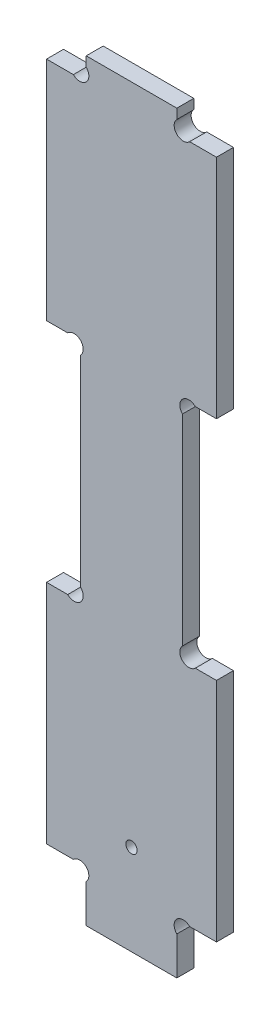
ISO-10303-21;
HEADER;
FILE_DESCRIPTION(('STEP AP214'),'2;1');
FILE_NAME('part.step','',(''),(''),'','','');
FILE_SCHEMA(('AUTOMOTIVE_DESIGN { 1 0 10303 214 1 1 1 1 }'));
ENDSEC;
DATA;
#1=APPLICATION_CONTEXT('core data for automotive mechanical design processes');
#2=APPLICATION_PROTOCOL_DEFINITION('international standard','automotive_design',2000,#1);
#3=PRODUCT_CONTEXT('',#1,'mechanical');
#4=PRODUCT('Part','Part','',(#3));
#5=PRODUCT_RELATED_PRODUCT_CATEGORY('part','',(#4));
#6=PRODUCT_DEFINITION_FORMATION('','',#4);
#7=PRODUCT_DEFINITION_CONTEXT('part definition',#1,'design');
#8=PRODUCT_DEFINITION('design','',#6,#7);
#9=PRODUCT_DEFINITION_SHAPE('','',#8);
#10=(LENGTH_UNIT() NAMED_UNIT(*) SI_UNIT(.MILLI.,.METRE.));
#11=(NAMED_UNIT(*) PLANE_ANGLE_UNIT() SI_UNIT($,.RADIAN.));
#12=(NAMED_UNIT(*) SI_UNIT($,.STERADIAN.) SOLID_ANGLE_UNIT());
#13=UNCERTAINTY_MEASURE_WITH_UNIT(LENGTH_MEASURE(1.E-05),#10,'distance_accuracy_value','');
#14=(GEOMETRIC_REPRESENTATION_CONTEXT(3) GLOBAL_UNCERTAINTY_ASSIGNED_CONTEXT((#13)) GLOBAL_UNIT_ASSIGNED_CONTEXT((#10,
#11,#12)) REPRESENTATION_CONTEXT('',''));
#15=CARTESIAN_POINT('',(0.,0.,0.));
#16=DIRECTION('',(0.,0.,1.));
#17=DIRECTION('',(1.,0.,0.));
#18=AXIS2_PLACEMENT_3D('',#15,#16,#17);
#19=CARTESIAN_POINT('',(30.,49.,3.));
#20=DIRECTION('',(-1.,0.,0.));
#21=DIRECTION('',(0.,-1.,0.));
#22=AXIS2_PLACEMENT_3D('',#19,#20,#21);
#23=PLANE('',#22);
#24=DIRECTION('',(0.,1.,0.));
#25=VECTOR('',#24,1.);
#26=CARTESIAN_POINT('',(30.,49.,0.));
#27=LINE('',#26,#25);
#28=CARTESIAN_POINT('',(30.,9.,0.));
#29=VERTEX_POINT('',#28);
#30=CARTESIAN_POINT('',(30.,49.,0.));
#31=VERTEX_POINT('',#30);
#32=EDGE_CURVE('E249',#29,#31,#27,.T.);
#33=ORIENTED_EDGE('',*,*,#32,.T.);
#34=DIRECTION('',(0.,0.,-1.));
#35=VECTOR('',#34,1.);
#36=CARTESIAN_POINT('',(30.,49.,3.));
#37=LINE('',#36,#35);
#38=CARTESIAN_POINT('',(30.,49.,3.));
#39=VERTEX_POINT('',#38);
#40=EDGE_CURVE('E11',#39,#31,#37,.T.);
#41=ORIENTED_EDGE('',*,*,#40,.F.);
#42=DIRECTION('',(0.,1.,0.));
#43=VECTOR('',#42,1.);
#44=CARTESIAN_POINT('',(30.,49.,3.));
#45=LINE('',#44,#43);
#46=CARTESIAN_POINT('',(30.,9.,3.));
#47=VERTEX_POINT('',#46);
#48=EDGE_CURVE('E304',#47,#39,#45,.T.);
#49=ORIENTED_EDGE('',*,*,#48,.F.);
#50=DIRECTION('',(0.,0.,-1.));
#51=VECTOR('',#50,1.);
#52=CARTESIAN_POINT('',(30.,9.,3.));
#53=LINE('',#52,#51);
#54=EDGE_CURVE('E245',#47,#29,#53,.T.);
#55=ORIENTED_EDGE('',*,*,#54,.T.);
#56=EDGE_LOOP('',(#33,#41,#49,#55));
#57=FACE_BOUND('',#56,.T.);
#58=ADVANCED_FACE('F33',(#57),#23,.F.);
#59=CARTESIAN_POINT('',(26.262741699797,49.,3.));
#60=DIRECTION('',(0.,-1.,0.));
#61=DIRECTION('',(0.,0.,-1.));
#62=AXIS2_PLACEMENT_3D('',#59,#60,#61);
#63=PLANE('',#62);
#64=DIRECTION('',(-1.,0.,0.));
#65=VECTOR('',#64,1.);
#66=CARTESIAN_POINT('',(26.262741699797,49.,0.));
#67=LINE('',#66,#65);
#68=CARTESIAN_POINT('',(26.262741699797,49.,0.));
#69=VERTEX_POINT('',#68);
#70=EDGE_CURVE('E252',#31,#69,#67,.T.);
#71=ORIENTED_EDGE('',*,*,#70,.T.);
#72=DIRECTION('',(0.,0.,-1.));
#73=VECTOR('',#72,1.);
#74=CARTESIAN_POINT('',(26.262741699797,49.,3.));
#75=LINE('',#74,#73);
#76=CARTESIAN_POINT('',(26.262741699797,49.,3.));
#77=VERTEX_POINT('',#76);
#78=EDGE_CURVE('E41',#77,#69,#75,.T.);
#79=ORIENTED_EDGE('',*,*,#78,.F.);
#80=DIRECTION('',(-1.,0.,0.));
#81=VECTOR('',#80,1.);
#82=CARTESIAN_POINT('',(26.262741699797,49.,3.));
#83=LINE('',#82,#81);
#84=EDGE_CURVE('E152',#39,#77,#83,.T.);
#85=ORIENTED_EDGE('',*,*,#84,.F.);
#86=ORIENTED_EDGE('',*,*,#40,.T.);
#87=EDGE_LOOP('',(#71,#79,#85,#86));
#88=FACE_BOUND('',#87,.T.);
#89=ADVANCED_FACE('F464',(#88),#63,.F.);
#90=CARTESIAN_POINT('',(25.1313708498985,50.1313708498985,3.));
#91=DIRECTION('',(0.,0.,-1.));
#92=DIRECTION('',(-1.,0.,0.));
#93=AXIS2_PLACEMENT_3D('',#90,#91,#92);
#94=CYLINDRICAL_SURFACE('',#93,1.60000000000001);
#95=CARTESIAN_POINT('',(25.1313708498985,50.1313708498985,0.));
#96=DIRECTION('',(0.,0.,-1.));
#97=DIRECTION('',(1.,0.,0.));
#98=AXIS2_PLACEMENT_3D('',#95,#96,#97);
#99=CIRCLE('',#98,1.60000000000001);
#100=CARTESIAN_POINT('',(24.,51.262741699797,0.));
#101=VERTEX_POINT('',#100);
#102=EDGE_CURVE('E255',#69,#101,#99,.T.);
#103=ORIENTED_EDGE('',*,*,#102,.T.);
#104=DIRECTION('',(0.,0.,-1.));
#105=VECTOR('',#104,1.);
#106=CARTESIAN_POINT('',(24.,51.262741699797,3.));
#107=LINE('',#106,#105);
#108=CARTESIAN_POINT('',(24.,51.262741699797,3.));
#109=VERTEX_POINT('',#108);
#110=EDGE_CURVE('E371',#109,#101,#107,.T.);
#111=ORIENTED_EDGE('',*,*,#110,.F.);
#112=CARTESIAN_POINT('',(25.1313708498985,50.1313708498985,3.));
#113=DIRECTION('',(0.,0.,-1.));
#114=DIRECTION('',(1.,0.,0.));
#115=AXIS2_PLACEMENT_3D('',#112,#113,#114);
#116=CIRCLE('',#115,1.60000000000001);
#117=EDGE_CURVE('E379',#77,#109,#116,.T.);
#118=ORIENTED_EDGE('',*,*,#117,.F.);
#119=ORIENTED_EDGE('',*,*,#78,.T.);
#120=EDGE_LOOP('',(#103,#111,#118,#119));
#121=FACE_BOUND('',#120,.T.);
#122=ADVANCED_FACE('F377',(#121),#94,.F.);
#123=CARTESIAN_POINT('',(24.,86.737258300203,3.));
#124=DIRECTION('',(-1.,0.,0.));
#125=DIRECTION('',(0.,-1.,0.));
#126=AXIS2_PLACEMENT_3D('',#123,#124,#125);
#127=PLANE('',#126);
#128=DIRECTION('',(0.,1.,0.));
#129=VECTOR('',#128,1.);
#130=CARTESIAN_POINT('',(24.,86.737258300203,0.));
#131=LINE('',#130,#129);
#132=CARTESIAN_POINT('',(24.,86.737258300203,0.));
#133=VERTEX_POINT('',#132);
#134=EDGE_CURVE('E257',#101,#133,#131,.T.);
#135=ORIENTED_EDGE('',*,*,#134,.T.);
#136=DIRECTION('',(0.,0.,-1.));
#137=VECTOR('',#136,1.);
#138=CARTESIAN_POINT('',(24.,86.737258300203,3.));
#139=LINE('',#138,#137);
#140=CARTESIAN_POINT('',(24.,86.737258300203,3.));
#141=VERTEX_POINT('',#140);
#142=EDGE_CURVE('E368',#141,#133,#139,.T.);
#143=ORIENTED_EDGE('',*,*,#142,.F.);
#144=DIRECTION('',(0.,1.,0.));
#145=VECTOR('',#144,1.);
#146=CARTESIAN_POINT('',(24.,86.737258300203,3.));
#147=LINE('',#146,#145);
#148=EDGE_CURVE('E397',#109,#141,#147,.T.);
#149=ORIENTED_EDGE('',*,*,#148,.F.);
#150=ORIENTED_EDGE('',*,*,#110,.T.);
#151=EDGE_LOOP('',(#135,#143,#149,#150));
#152=FACE_BOUND('',#151,.T.);
#153=ADVANCED_FACE('F388',(#152),#127,.F.);
#154=CARTESIAN_POINT('',(25.1313708498985,87.8686291501015,3.));
#155=DIRECTION('',(0.,0.,-1.));
#156=DIRECTION('',(-1.,0.,0.));
#157=AXIS2_PLACEMENT_3D('',#154,#155,#156);
#158=CYLINDRICAL_SURFACE('',#157,1.6);
#159=CARTESIAN_POINT('',(25.1313708498985,87.8686291501015,0.));
#160=DIRECTION('',(0.,0.,-1.));
#161=DIRECTION('',(-1.,0.,0.));
#162=AXIS2_PLACEMENT_3D('',#159,#160,#161);
#163=CIRCLE('',#162,1.6);
#164=CARTESIAN_POINT('',(26.2627416997969,89.,0.));
#165=VERTEX_POINT('',#164);
#166=EDGE_CURVE('E259',#133,#165,#163,.T.);
#167=ORIENTED_EDGE('',*,*,#166,.T.);
#168=DIRECTION('',(0.,0.,-1.));
#169=VECTOR('',#168,1.);
#170=CARTESIAN_POINT('',(26.2627416997969,89.,3.));
#171=LINE('',#170,#169);
#172=CARTESIAN_POINT('',(26.2627416997969,89.,3.));
#173=VERTEX_POINT('',#172);
#174=EDGE_CURVE('E365',#173,#165,#171,.T.);
#175=ORIENTED_EDGE('',*,*,#174,.F.);
#176=CARTESIAN_POINT('',(25.1313708498985,87.8686291501015,3.));
#177=DIRECTION('',(0.,0.,-1.));
#178=DIRECTION('',(-1.,0.,0.));
#179=AXIS2_PLACEMENT_3D('',#176,#177,#178);
#180=CIRCLE('',#179,1.6);
#181=EDGE_CURVE('E394',#141,#173,#180,.T.);
#182=ORIENTED_EDGE('',*,*,#181,.F.);
#183=ORIENTED_EDGE('',*,*,#142,.T.);
#184=EDGE_LOOP('',(#167,#175,#182,#183));
#185=FACE_BOUND('',#184,.T.);
#186=ADVANCED_FACE('F392',(#185),#158,.F.);
#187=CARTESIAN_POINT('',(26.2627416997969,89.,3.));
#188=DIRECTION('',(0.,1.,0.));
#189=DIRECTION('',(0.,0.,1.));
#190=AXIS2_PLACEMENT_3D('',#187,#188,#189);
#191=PLANE('',#190);
#192=DIRECTION('',(1.,0.,0.));
#193=VECTOR('',#192,1.);
#194=CARTESIAN_POINT('',(26.2627416997969,89.,0.));
#195=LINE('',#194,#193);
#196=CARTESIAN_POINT('',(30.,89.,0.));
#197=VERTEX_POINT('',#196);
#198=EDGE_CURVE('E261',#165,#197,#195,.T.);
#199=ORIENTED_EDGE('',*,*,#198,.T.);
#200=DIRECTION('',(0.,0.,-1.));
#201=VECTOR('',#200,1.);
#202=CARTESIAN_POINT('',(30.,89.,3.));
#203=LINE('',#202,#201);
#204=CARTESIAN_POINT('',(30.,89.,3.));
#205=VERTEX_POINT('',#204);
#206=EDGE_CURVE('E362',#205,#197,#203,.T.);
#207=ORIENTED_EDGE('',*,*,#206,.F.);
#208=DIRECTION('',(1.,0.,0.));
#209=VECTOR('',#208,1.);
#210=CARTESIAN_POINT('',(26.2627416997969,89.,3.));
#211=LINE('',#210,#209);
#212=EDGE_CURVE('E396',#173,#205,#211,.T.);
#213=ORIENTED_EDGE('',*,*,#212,.F.);
#214=ORIENTED_EDGE('',*,*,#174,.T.);
#215=EDGE_LOOP('',(#199,#207,#213,#214));
#216=FACE_BOUND('',#215,.T.);
#217=ADVANCED_FACE('F477',(#216),#191,.F.);
#218=CARTESIAN_POINT('',(30.,89.,3.));
#219=DIRECTION('',(-1.,0.,0.));
#220=DIRECTION('',(0.,0.,1.));
#221=AXIS2_PLACEMENT_3D('',#218,#219,#220);
#222=PLANE('',#221);
#223=DIRECTION('',(0.,1.,0.));
#224=VECTOR('',#223,1.);
#225=CARTESIAN_POINT('',(30.,89.,0.));
#226=LINE('',#225,#224);
#227=CARTESIAN_POINT('',(30.,129.,0.));
#228=VERTEX_POINT('',#227);
#229=EDGE_CURVE('E263',#197,#228,#226,.T.);
#230=ORIENTED_EDGE('',*,*,#229,.T.);
#231=DIRECTION('',(0.,0.,-1.));
#232=VECTOR('',#231,1.);
#233=CARTESIAN_POINT('',(30.,129.,3.));
#234=LINE('',#233,#232);
#235=CARTESIAN_POINT('',(30.,129.,3.));
#236=VERTEX_POINT('',#235);
#237=EDGE_CURVE('E359',#236,#228,#234,.T.);
#238=ORIENTED_EDGE('',*,*,#237,.F.);
#239=DIRECTION('',(0.,1.,0.));
#240=VECTOR('',#239,1.);
#241=CARTESIAN_POINT('',(30.,89.,3.));
#242=LINE('',#241,#240);
#243=EDGE_CURVE('E399',#205,#236,#242,.T.);
#244=ORIENTED_EDGE('',*,*,#243,.F.);
#245=ORIENTED_EDGE('',*,*,#206,.T.);
#246=EDGE_LOOP('',(#230,#238,#244,#245));
#247=FACE_BOUND('',#246,.T.);
#248=ADVANCED_FACE('F480',(#247),#222,.F.);
#249=CARTESIAN_POINT('',(25.262741699797,129.,3.));
#250=DIRECTION('',(0.,-1.,0.));
#251=DIRECTION('',(0.,0.,-1.));
#252=AXIS2_PLACEMENT_3D('',#249,#250,#251);
#253=PLANE('',#252);
#254=DIRECTION('',(-1.,0.,0.));
#255=VECTOR('',#254,1.);
#256=CARTESIAN_POINT('',(25.262741699797,129.,0.));
#257=LINE('',#256,#255);
#258=CARTESIAN_POINT('',(25.262741699797,129.,0.));
#259=VERTEX_POINT('',#258);
#260=EDGE_CURVE('E265',#228,#259,#257,.T.);
#261=ORIENTED_EDGE('',*,*,#260,.T.);
#262=DIRECTION('',(0.,0.,-1.));
#263=VECTOR('',#262,1.);
#264=CARTESIAN_POINT('',(25.262741699797,129.,3.));
#265=LINE('',#264,#263);
#266=CARTESIAN_POINT('',(25.262741699797,129.,3.));
#267=VERTEX_POINT('',#266);
#268=EDGE_CURVE('E356',#267,#259,#265,.T.);
#269=ORIENTED_EDGE('',*,*,#268,.F.);
#270=DIRECTION('',(-1.,0.,0.));
#271=VECTOR('',#270,1.);
#272=CARTESIAN_POINT('',(25.262741699797,129.,3.));
#273=LINE('',#272,#271);
#274=EDGE_CURVE('E405',#236,#267,#273,.T.);
#275=ORIENTED_EDGE('',*,*,#274,.F.);
#276=ORIENTED_EDGE('',*,*,#237,.T.);
#277=EDGE_LOOP('',(#261,#269,#275,#276));
#278=FACE_BOUND('',#277,.T.);
#279=ADVANCED_FACE('F484',(#278),#253,.F.);
#280=CARTESIAN_POINT('',(24.1313708498985,130.131370849898,3.));
#281=DIRECTION('',(0.,0.,-1.));
#282=DIRECTION('',(-1.,0.,0.));
#283=AXIS2_PLACEMENT_3D('',#280,#281,#282);
#284=CYLINDRICAL_SURFACE('',#283,1.60000000000001);
#285=CARTESIAN_POINT('',(24.1313708498985,130.131370849898,0.));
#286=DIRECTION('',(0.,0.,-1.));
#287=DIRECTION('',(-1.,0.,0.));
#288=AXIS2_PLACEMENT_3D('',#285,#286,#287);
#289=CIRCLE('',#288,1.60000000000001);
#290=CARTESIAN_POINT('',(23.,131.262741699797,0.));
#291=VERTEX_POINT('',#290);
#292=EDGE_CURVE('E267',#259,#291,#289,.T.);
#293=ORIENTED_EDGE('',*,*,#292,.T.);
#294=DIRECTION('',(0.,0.,-1.));
#295=VECTOR('',#294,1.);
#296=CARTESIAN_POINT('',(23.,131.262741699797,3.));
#297=LINE('',#296,#295);
#298=CARTESIAN_POINT('',(23.,131.262741699797,3.));
#299=VERTEX_POINT('',#298);
#300=EDGE_CURVE('E353',#299,#291,#297,.T.);
#301=ORIENTED_EDGE('',*,*,#300,.F.);
#302=CARTESIAN_POINT('',(24.1313708498985,130.131370849898,3.));
#303=DIRECTION('',(0.,0.,-1.));
#304=DIRECTION('',(-1.,0.,0.));
#305=AXIS2_PLACEMENT_3D('',#302,#303,#304);
#306=CIRCLE('',#305,1.60000000000001);
#307=EDGE_CURVE('E407',#267,#299,#306,.T.);
#308=ORIENTED_EDGE('',*,*,#307,.F.);
#309=ORIENTED_EDGE('',*,*,#268,.T.);
#310=EDGE_LOOP('',(#293,#301,#308,#309));
#311=FACE_BOUND('',#310,.T.);
#312=ADVANCED_FACE('F488',(#311),#284,.F.);
#313=CARTESIAN_POINT('',(23.,131.262741699797,3.));
#314=DIRECTION('',(-1.,0.,0.));
#315=DIRECTION('',(0.,0.,1.));
#316=AXIS2_PLACEMENT_3D('',#313,#314,#315);
#317=PLANE('',#316);
#318=DIRECTION('',(0.,1.,0.));
#319=VECTOR('',#318,1.);
#320=CARTESIAN_POINT('',(23.,131.262741699797,0.));
#321=LINE('',#320,#319);
#322=CARTESIAN_POINT('',(23.,133.,0.));
#323=VERTEX_POINT('',#322);
#324=EDGE_CURVE('E269',#291,#323,#321,.T.);
#325=ORIENTED_EDGE('',*,*,#324,.T.);
#326=DIRECTION('',(0.,0.,-1.));
#327=VECTOR('',#326,1.);
#328=CARTESIAN_POINT('',(23.,133.,3.));
#329=LINE('',#328,#327);
#330=CARTESIAN_POINT('',(23.,133.,3.));
#331=VERTEX_POINT('',#330);
#332=EDGE_CURVE('E350',#331,#323,#329,.T.);
#333=ORIENTED_EDGE('',*,*,#332,.F.);
#334=DIRECTION('',(0.,1.,0.));
#335=VECTOR('',#334,1.);
#336=CARTESIAN_POINT('',(23.,131.262741699797,3.));
#337=LINE('',#336,#335);
#338=EDGE_CURVE('E409',#299,#331,#337,.T.);
#339=ORIENTED_EDGE('',*,*,#338,.F.);
#340=ORIENTED_EDGE('',*,*,#300,.T.);
#341=EDGE_LOOP('',(#325,#333,#339,#340));
#342=FACE_BOUND('',#341,.T.);
#343=ADVANCED_FACE('F492',(#342),#317,.F.);
#344=CARTESIAN_POINT('',(6.99999999999998,133.,3.));
#345=DIRECTION('',(0.,-1.,0.));
#346=DIRECTION('',(0.,0.,-1.));
#347=AXIS2_PLACEMENT_3D('',#344,#345,#346);
#348=PLANE('',#347);
#349=DIRECTION('',(-1.,0.,0.));
#350=VECTOR('',#349,1.);
#351=CARTESIAN_POINT('',(6.99999999999998,133.,0.));
#352=LINE('',#351,#350);
#353=CARTESIAN_POINT('',(6.99999999999998,133.,0.));
#354=VERTEX_POINT('',#353);
#355=EDGE_CURVE('E271',#323,#354,#352,.T.);
#356=ORIENTED_EDGE('',*,*,#355,.T.);
#357=DIRECTION('',(0.,0.,-1.));
#358=VECTOR('',#357,1.);
#359=CARTESIAN_POINT('',(6.99999999999998,133.,3.));
#360=LINE('',#359,#358);
#361=CARTESIAN_POINT('',(6.99999999999998,133.,3.));
#362=VERTEX_POINT('',#361);
#363=EDGE_CURVE('E347',#362,#354,#360,.T.);
#364=ORIENTED_EDGE('',*,*,#363,.F.);
#365=DIRECTION('',(-1.,0.,0.));
#366=VECTOR('',#365,1.);
#367=CARTESIAN_POINT('',(6.99999999999998,133.,3.));
#368=LINE('',#367,#366);
#369=EDGE_CURVE('E411',#331,#362,#368,.T.);
#370=ORIENTED_EDGE('',*,*,#369,.F.);
#371=ORIENTED_EDGE('',*,*,#332,.T.);
#372=EDGE_LOOP('',(#356,#364,#370,#371));
#373=FACE_BOUND('',#372,.T.);
#374=ADVANCED_FACE('F496',(#373),#348,.F.);
#375=CARTESIAN_POINT('',(6.99999999999998,131.262741699797,3.));
#376=DIRECTION('',(1.,0.,0.));
#377=DIRECTION('',(0.,0.,-1.));
#378=AXIS2_PLACEMENT_3D('',#375,#376,#377);
#379=PLANE('',#378);
#380=DIRECTION('',(0.,-1.,0.));
#381=VECTOR('',#380,1.);
#382=CARTESIAN_POINT('',(6.99999999999998,131.262741699797,0.));
#383=LINE('',#382,#381);
#384=CARTESIAN_POINT('',(6.99999999999998,131.262741699797,0.));
#385=VERTEX_POINT('',#384);
#386=EDGE_CURVE('E273',#354,#385,#383,.T.);
#387=ORIENTED_EDGE('',*,*,#386,.T.);
#388=DIRECTION('',(0.,0.,-1.));
#389=VECTOR('',#388,1.);
#390=CARTESIAN_POINT('',(6.99999999999998,131.262741699797,3.));
#391=LINE('',#390,#389);
#392=CARTESIAN_POINT('',(6.99999999999998,131.262741699797,3.));
#393=VERTEX_POINT('',#392);
#394=EDGE_CURVE('E344',#393,#385,#391,.T.);
#395=ORIENTED_EDGE('',*,*,#394,.F.);
#396=DIRECTION('',(0.,-1.,0.));
#397=VECTOR('',#396,1.);
#398=CARTESIAN_POINT('',(6.99999999999998,131.262741699797,3.));
#399=LINE('',#398,#397);
#400=EDGE_CURVE('E413',#362,#393,#399,.T.);
#401=ORIENTED_EDGE('',*,*,#400,.F.);
#402=ORIENTED_EDGE('',*,*,#363,.T.);
#403=EDGE_LOOP('',(#387,#395,#401,#402));
#404=FACE_BOUND('',#403,.T.);
#405=ADVANCED_FACE('F500',(#404),#379,.F.);
#406=CARTESIAN_POINT('',(5.8686291501015,130.131370849898,3.));
#407=DIRECTION('',(0.,0.,-1.));
#408=DIRECTION('',(-1.,0.,0.));
#409=AXIS2_PLACEMENT_3D('',#406,#407,#408);
#410=CYLINDRICAL_SURFACE('',#409,1.6);
#411=CARTESIAN_POINT('',(5.8686291501015,130.131370849898,0.));
#412=DIRECTION('',(0.,0.,-1.));
#413=DIRECTION('',(1.,0.,0.));
#414=AXIS2_PLACEMENT_3D('',#411,#412,#413);
#415=CIRCLE('',#414,1.6);
#416=CARTESIAN_POINT('',(4.73725830020302,129.,0.));
#417=VERTEX_POINT('',#416);
#418=EDGE_CURVE('E275',#385,#417,#415,.T.);
#419=ORIENTED_EDGE('',*,*,#418,.T.);
#420=DIRECTION('',(0.,0.,-1.));
#421=VECTOR('',#420,1.);
#422=CARTESIAN_POINT('',(4.73725830020302,129.,3.));
#423=LINE('',#422,#421);
#424=CARTESIAN_POINT('',(4.73725830020302,129.,3.));
#425=VERTEX_POINT('',#424);
#426=EDGE_CURVE('E341',#425,#417,#423,.T.);
#427=ORIENTED_EDGE('',*,*,#426,.F.);
#428=CARTESIAN_POINT('',(5.8686291501015,130.131370849898,3.));
#429=DIRECTION('',(0.,0.,-1.));
#430=DIRECTION('',(1.,0.,0.));
#431=AXIS2_PLACEMENT_3D('',#428,#429,#430);
#432=CIRCLE('',#431,1.6);
#433=EDGE_CURVE('E415',#393,#425,#432,.T.);
#434=ORIENTED_EDGE('',*,*,#433,.F.);
#435=ORIENTED_EDGE('',*,*,#394,.T.);
#436=EDGE_LOOP('',(#419,#427,#434,#435));
#437=FACE_BOUND('',#436,.T.);
#438=ADVANCED_FACE('F504',(#437),#410,.F.);
#439=CARTESIAN_POINT('',(4.73725830020302,129.,3.));
#440=DIRECTION('',(0.,-1.,0.));
#441=DIRECTION('',(0.,0.,-1.));
#442=AXIS2_PLACEMENT_3D('',#439,#440,#441);
#443=PLANE('',#442);
#444=DIRECTION('',(-1.,0.,0.));
#445=VECTOR('',#444,1.);
#446=CARTESIAN_POINT('',(4.73725830020302,129.,0.));
#447=LINE('',#446,#445);
#448=CARTESIAN_POINT('',(0.,129.,0.));
#449=VERTEX_POINT('',#448);
#450=EDGE_CURVE('E277',#417,#449,#447,.T.);
#451=ORIENTED_EDGE('',*,*,#450,.T.);
#452=DIRECTION('',(0.,0.,-1.));
#453=VECTOR('',#452,1.);
#454=CARTESIAN_POINT('',(0.,129.,3.));
#455=LINE('',#454,#453);
#456=CARTESIAN_POINT('',(0.,129.,3.));
#457=VERTEX_POINT('',#456);
#458=EDGE_CURVE('E338',#457,#449,#455,.T.);
#459=ORIENTED_EDGE('',*,*,#458,.F.);
#460=DIRECTION('',(-1.,0.,0.));
#461=VECTOR('',#460,1.);
#462=CARTESIAN_POINT('',(4.73725830020302,129.,3.));
#463=LINE('',#462,#461);
#464=EDGE_CURVE('E417',#425,#457,#463,.T.);
#465=ORIENTED_EDGE('',*,*,#464,.F.);
#466=ORIENTED_EDGE('',*,*,#426,.T.);
#467=EDGE_LOOP('',(#451,#459,#465,#466));
#468=FACE_BOUND('',#467,.T.);
#469=ADVANCED_FACE('F508',(#468),#443,.F.);
#470=CARTESIAN_POINT('',(0.,89.,3.));
#471=DIRECTION('',(1.,0.,0.));
#472=DIRECTION('',(0.,1.,0.));
#473=AXIS2_PLACEMENT_3D('',#470,#471,#472);
#474=PLANE('',#473);
#475=DIRECTION('',(0.,-1.,0.));
#476=VECTOR('',#475,1.);
#477=CARTESIAN_POINT('',(0.,89.,0.));
#478=LINE('',#477,#476);
#479=CARTESIAN_POINT('',(0.,89.,0.));
#480=VERTEX_POINT('',#479);
#481=EDGE_CURVE('E279',#449,#480,#478,.T.);
#482=ORIENTED_EDGE('',*,*,#481,.T.);
#483=DIRECTION('',(0.,0.,-1.));
#484=VECTOR('',#483,1.);
#485=CARTESIAN_POINT('',(0.,89.,3.));
#486=LINE('',#485,#484);
#487=CARTESIAN_POINT('',(0.,89.,3.));
#488=VERTEX_POINT('',#487);
#489=EDGE_CURVE('E335',#488,#480,#486,.T.);
#490=ORIENTED_EDGE('',*,*,#489,.F.);
#491=DIRECTION('',(0.,-1.,0.));
#492=VECTOR('',#491,1.);
#493=CARTESIAN_POINT('',(0.,89.,3.));
#494=LINE('',#493,#492);
#495=EDGE_CURVE('E419',#457,#488,#494,.T.);
#496=ORIENTED_EDGE('',*,*,#495,.F.);
#497=ORIENTED_EDGE('',*,*,#458,.T.);
#498=EDGE_LOOP('',(#482,#490,#496,#497));
#499=FACE_BOUND('',#498,.T.);
#500=ADVANCED_FACE('F512',(#499),#474,.F.);
#501=CARTESIAN_POINT('',(3.73725830020304,89.,3.));
#502=DIRECTION('',(0.,1.,0.));
#503=DIRECTION('',(0.,0.,1.));
#504=AXIS2_PLACEMENT_3D('',#501,#502,#503);
#505=PLANE('',#504);
#506=DIRECTION('',(1.,0.,0.));
#507=VECTOR('',#506,1.);
#508=CARTESIAN_POINT('',(3.73725830020304,89.,0.));
#509=LINE('',#508,#507);
#510=CARTESIAN_POINT('',(3.73725830020304,89.,0.));
#511=VERTEX_POINT('',#510);
#512=EDGE_CURVE('E281',#480,#511,#509,.T.);
#513=ORIENTED_EDGE('',*,*,#512,.T.);
#514=DIRECTION('',(0.,0.,-1.));
#515=VECTOR('',#514,1.);
#516=CARTESIAN_POINT('',(3.73725830020304,89.,3.));
#517=LINE('',#516,#515);
#518=CARTESIAN_POINT('',(3.73725830020304,89.,3.));
#519=VERTEX_POINT('',#518);
#520=EDGE_CURVE('E332',#519,#511,#517,.T.);
#521=ORIENTED_EDGE('',*,*,#520,.F.);
#522=DIRECTION('',(1.,0.,0.));
#523=VECTOR('',#522,1.);
#524=CARTESIAN_POINT('',(3.73725830020304,89.,3.));
#525=LINE('',#524,#523);
#526=EDGE_CURVE('E421',#488,#519,#525,.T.);
#527=ORIENTED_EDGE('',*,*,#526,.F.);
#528=ORIENTED_EDGE('',*,*,#489,.T.);
#529=EDGE_LOOP('',(#513,#521,#527,#528));
#530=FACE_BOUND('',#529,.T.);
#531=ADVANCED_FACE('F516',(#530),#505,.F.);
#532=CARTESIAN_POINT('',(4.86862915010152,87.8686291501015,3.));
#533=DIRECTION('',(0.,0.,-1.));
#534=DIRECTION('',(-1.,0.,0.));
#535=AXIS2_PLACEMENT_3D('',#532,#533,#534);
#536=CYLINDRICAL_SURFACE('',#535,1.6);
#537=CARTESIAN_POINT('',(4.86862915010152,87.8686291501015,0.));
#538=DIRECTION('',(0.,0.,-1.));
#539=DIRECTION('',(1.,0.,0.));
#540=AXIS2_PLACEMENT_3D('',#537,#538,#539);
#541=CIRCLE('',#540,1.6);
#542=CARTESIAN_POINT('',(5.99999999999999,86.737258300203,0.));
#543=VERTEX_POINT('',#542);
#544=EDGE_CURVE('E283',#511,#543,#541,.T.);
#545=ORIENTED_EDGE('',*,*,#544,.T.);
#546=DIRECTION('',(0.,0.,-1.));
#547=VECTOR('',#546,1.);
#548=CARTESIAN_POINT('',(5.99999999999999,86.737258300203,3.));
#549=LINE('',#548,#547);
#550=CARTESIAN_POINT('',(5.99999999999999,86.737258300203,3.));
#551=VERTEX_POINT('',#550);
#552=EDGE_CURVE('E329',#551,#543,#549,.T.);
#553=ORIENTED_EDGE('',*,*,#552,.F.);
#554=CARTESIAN_POINT('',(4.86862915010152,87.8686291501015,3.));
#555=DIRECTION('',(0.,0.,-1.));
#556=DIRECTION('',(1.,0.,0.));
#557=AXIS2_PLACEMENT_3D('',#554,#555,#556);
#558=CIRCLE('',#557,1.6);
#559=EDGE_CURVE('E423',#519,#551,#558,.T.);
#560=ORIENTED_EDGE('',*,*,#559,.F.);
#561=ORIENTED_EDGE('',*,*,#520,.T.);
#562=EDGE_LOOP('',(#545,#553,#560,#561));
#563=FACE_BOUND('',#562,.T.);
#564=ADVANCED_FACE('F520',(#563),#536,.F.);
#565=CARTESIAN_POINT('',(5.99999999999999,86.737258300203,3.));
#566=DIRECTION('',(1.,0.,0.));
#567=DIRECTION('',(0.,1.,0.));
#568=AXIS2_PLACEMENT_3D('',#565,#566,#567);
#569=PLANE('',#568);
#570=DIRECTION('',(0.,-1.,0.));
#571=VECTOR('',#570,1.);
#572=CARTESIAN_POINT('',(5.99999999999999,86.737258300203,0.));
#573=LINE('',#572,#571);
#574=CARTESIAN_POINT('',(6.,51.262741699797,0.));
#575=VERTEX_POINT('',#574);
#576=EDGE_CURVE('E285',#543,#575,#573,.T.);
#577=ORIENTED_EDGE('',*,*,#576,.T.);
#578=DIRECTION('',(0.,0.,-1.));
#579=VECTOR('',#578,1.);
#580=CARTESIAN_POINT('',(6.,51.262741699797,3.));
#581=LINE('',#580,#579);
#582=CARTESIAN_POINT('',(6.,51.262741699797,3.));
#583=VERTEX_POINT('',#582);
#584=EDGE_CURVE('E326',#583,#575,#581,.T.);
#585=ORIENTED_EDGE('',*,*,#584,.F.);
#586=DIRECTION('',(0.,-1.,0.));
#587=VECTOR('',#586,1.);
#588=CARTESIAN_POINT('',(5.99999999999999,86.737258300203,3.));
#589=LINE('',#588,#587);
#590=EDGE_CURVE('E425',#551,#583,#589,.T.);
#591=ORIENTED_EDGE('',*,*,#590,.F.);
#592=ORIENTED_EDGE('',*,*,#552,.T.);
#593=EDGE_LOOP('',(#577,#585,#591,#592));
#594=FACE_BOUND('',#593,.T.);
#595=ADVANCED_FACE('F524',(#594),#569,.F.);
#596=CARTESIAN_POINT('',(4.86862915010152,50.1313708498985,3.));
#597=DIRECTION('',(0.,0.,-1.));
#598=DIRECTION('',(-1.,0.,0.));
#599=AXIS2_PLACEMENT_3D('',#596,#597,#598);
#600=CYLINDRICAL_SURFACE('',#599,1.6);
#601=CARTESIAN_POINT('',(4.86862915010152,50.1313708498985,0.));
#602=DIRECTION('',(0.,0.,-1.));
#603=DIRECTION('',(-1.,0.,0.));
#604=AXIS2_PLACEMENT_3D('',#601,#602,#603);
#605=CIRCLE('',#604,1.6);
#606=CARTESIAN_POINT('',(3.73725830020305,49.,0.));
#607=VERTEX_POINT('',#606);
#608=EDGE_CURVE('E287',#575,#607,#605,.T.);
#609=ORIENTED_EDGE('',*,*,#608,.T.);
#610=DIRECTION('',(0.,0.,-1.));
#611=VECTOR('',#610,1.);
#612=CARTESIAN_POINT('',(3.73725830020305,49.,3.));
#613=LINE('',#612,#611);
#614=CARTESIAN_POINT('',(3.73725830020305,49.,3.));
#615=VERTEX_POINT('',#614);
#616=EDGE_CURVE('E323',#615,#607,#613,.T.);
#617=ORIENTED_EDGE('',*,*,#616,.F.);
#618=CARTESIAN_POINT('',(4.86862915010152,50.1313708498985,3.));
#619=DIRECTION('',(0.,0.,-1.));
#620=DIRECTION('',(-1.,0.,0.));
#621=AXIS2_PLACEMENT_3D('',#618,#619,#620);
#622=CIRCLE('',#621,1.6);
#623=EDGE_CURVE('E427',#583,#615,#622,.T.);
#624=ORIENTED_EDGE('',*,*,#623,.F.);
#625=ORIENTED_EDGE('',*,*,#584,.T.);
#626=EDGE_LOOP('',(#609,#617,#624,#625));
#627=FACE_BOUND('',#626,.T.);
#628=ADVANCED_FACE('F528',(#627),#600,.F.);
#629=CARTESIAN_POINT('',(3.73725830020305,49.,3.));
#630=DIRECTION('',(0.,-1.,0.));
#631=DIRECTION('',(0.,0.,-1.));
#632=AXIS2_PLACEMENT_3D('',#629,#630,#631);
#633=PLANE('',#632);
#634=DIRECTION('',(-1.,0.,0.));
#635=VECTOR('',#634,1.);
#636=CARTESIAN_POINT('',(3.73725830020305,49.,0.));
#637=LINE('',#636,#635);
#638=CARTESIAN_POINT('',(0.,49.,0.));
#639=VERTEX_POINT('',#638);
#640=EDGE_CURVE('E289',#607,#639,#637,.T.);
#641=ORIENTED_EDGE('',*,*,#640,.T.);
#642=DIRECTION('',(0.,0.,-1.));
#643=VECTOR('',#642,1.);
#644=CARTESIAN_POINT('',(0.,49.,3.));
#645=LINE('',#644,#643);
#646=CARTESIAN_POINT('',(0.,49.,3.));
#647=VERTEX_POINT('',#646);
#648=EDGE_CURVE('E320',#647,#639,#645,.T.);
#649=ORIENTED_EDGE('',*,*,#648,.F.);
#650=DIRECTION('',(-1.,0.,0.));
#651=VECTOR('',#650,1.);
#652=CARTESIAN_POINT('',(3.73725830020305,49.,3.));
#653=LINE('',#652,#651);
#654=EDGE_CURVE('E429',#615,#647,#653,.T.);
#655=ORIENTED_EDGE('',*,*,#654,.F.);
#656=ORIENTED_EDGE('',*,*,#616,.T.);
#657=EDGE_LOOP('',(#641,#649,#655,#656));
#658=FACE_BOUND('',#657,.T.);
#659=ADVANCED_FACE('F532',(#658),#633,.F.);
#660=CARTESIAN_POINT('',(0.,49.,3.));
#661=DIRECTION('',(1.,0.,0.));
#662=DIRECTION('',(0.,1.,0.));
#663=AXIS2_PLACEMENT_3D('',#660,#661,#662);
#664=PLANE('',#663);
#665=DIRECTION('',(0.,-1.,0.));
#666=VECTOR('',#665,1.);
#667=CARTESIAN_POINT('',(0.,49.,0.));
#668=LINE('',#667,#666);
#669=CARTESIAN_POINT('',(0.,9.,0.));
#670=VERTEX_POINT('',#669);
#671=EDGE_CURVE('E291',#639,#670,#668,.T.);
#672=ORIENTED_EDGE('',*,*,#671,.T.);
#673=DIRECTION('',(0.,0.,-1.));
#674=VECTOR('',#673,1.);
#675=CARTESIAN_POINT('',(0.,9.,3.));
#676=LINE('',#675,#674);
#677=CARTESIAN_POINT('',(0.,9.,3.));
#678=VERTEX_POINT('',#677);
#679=EDGE_CURVE('E317',#678,#670,#676,.T.);
#680=ORIENTED_EDGE('',*,*,#679,.F.);
#681=DIRECTION('',(0.,-1.,0.));
#682=VECTOR('',#681,1.);
#683=CARTESIAN_POINT('',(0.,49.,3.));
#684=LINE('',#683,#682);
#685=EDGE_CURVE('E431',#647,#678,#684,.T.);
#686=ORIENTED_EDGE('',*,*,#685,.F.);
#687=ORIENTED_EDGE('',*,*,#648,.T.);
#688=EDGE_LOOP('',(#672,#680,#686,#687));
#689=FACE_BOUND('',#688,.T.);
#690=ADVANCED_FACE('F536',(#689),#664,.F.);
#691=CARTESIAN_POINT('',(4.73725830020302,9.,3.));
#692=DIRECTION('',(0.,1.,0.));
#693=DIRECTION('',(0.,0.,1.));
#694=AXIS2_PLACEMENT_3D('',#691,#692,#693);
#695=PLANE('',#694);
#696=DIRECTION('',(1.,0.,0.));
#697=VECTOR('',#696,1.);
#698=CARTESIAN_POINT('',(4.73725830020302,9.,0.));
#699=LINE('',#698,#697);
#700=CARTESIAN_POINT('',(4.73725830020302,9.,0.));
#701=VERTEX_POINT('',#700);
#702=EDGE_CURVE('E293',#670,#701,#699,.T.);
#703=ORIENTED_EDGE('',*,*,#702,.T.);
#704=DIRECTION('',(0.,0.,-1.));
#705=VECTOR('',#704,1.);
#706=CARTESIAN_POINT('',(4.73725830020302,9.,3.));
#707=LINE('',#706,#705);
#708=CARTESIAN_POINT('',(4.73725830020302,9.,3.));
#709=VERTEX_POINT('',#708);
#710=EDGE_CURVE('E314',#709,#701,#707,.T.);
#711=ORIENTED_EDGE('',*,*,#710,.F.);
#712=DIRECTION('',(1.,0.,0.));
#713=VECTOR('',#712,1.);
#714=CARTESIAN_POINT('',(4.73725830020302,9.,3.));
#715=LINE('',#714,#713);
#716=EDGE_CURVE('E433',#678,#709,#715,.T.);
#717=ORIENTED_EDGE('',*,*,#716,.F.);
#718=ORIENTED_EDGE('',*,*,#679,.T.);
#719=EDGE_LOOP('',(#703,#711,#717,#718));
#720=FACE_BOUND('',#719,.T.);
#721=ADVANCED_FACE('F540',(#720),#695,.F.);
#722=CARTESIAN_POINT('',(5.8686291501015,7.86862915010153,3.));
#723=DIRECTION('',(0.,0.,-1.));
#724=DIRECTION('',(-1.,0.,0.));
#725=AXIS2_PLACEMENT_3D('',#722,#723,#724);
#726=CYLINDRICAL_SURFACE('',#725,1.6);
#727=CARTESIAN_POINT('',(5.8686291501015,7.86862915010153,0.));
#728=DIRECTION('',(0.,0.,-1.));
#729=DIRECTION('',(-1.,0.,0.));
#730=AXIS2_PLACEMENT_3D('',#727,#728,#729);
#731=CIRCLE('',#730,1.6);
#732=CARTESIAN_POINT('',(6.99999999999999,6.73725830020305,0.));
#733=VERTEX_POINT('',#732);
#734=EDGE_CURVE('E295',#701,#733,#731,.T.);
#735=ORIENTED_EDGE('',*,*,#734,.T.);
#736=DIRECTION('',(0.,0.,-1.));
#737=VECTOR('',#736,1.);
#738=CARTESIAN_POINT('',(6.99999999999999,6.73725830020305,3.));
#739=LINE('',#738,#737);
#740=CARTESIAN_POINT('',(6.99999999999999,6.73725830020305,3.));
#741=VERTEX_POINT('',#740);
#742=EDGE_CURVE('E311',#741,#733,#739,.T.);
#743=ORIENTED_EDGE('',*,*,#742,.F.);
#744=CARTESIAN_POINT('',(5.8686291501015,7.86862915010153,3.));
#745=DIRECTION('',(0.,0.,-1.));
#746=DIRECTION('',(-1.,0.,0.));
#747=AXIS2_PLACEMENT_3D('',#744,#745,#746);
#748=CIRCLE('',#747,1.6);
#749=EDGE_CURVE('E435',#709,#741,#748,.T.);
#750=ORIENTED_EDGE('',*,*,#749,.F.);
#751=ORIENTED_EDGE('',*,*,#710,.T.);
#752=EDGE_LOOP('',(#735,#743,#750,#751));
#753=FACE_BOUND('',#752,.T.);
#754=ADVANCED_FACE('F544',(#753),#726,.F.);
#755=CARTESIAN_POINT('',(6.99999999999999,6.73725830020305,3.));
#756=DIRECTION('',(1.,0.,0.));
#757=DIRECTION('',(0.,1.,0.));
#758=AXIS2_PLACEMENT_3D('',#755,#756,#757);
#759=PLANE('',#758);
#760=DIRECTION('',(0.,-1.,0.));
#761=VECTOR('',#760,1.);
#762=CARTESIAN_POINT('',(6.99999999999999,6.73725830020305,0.));
#763=LINE('',#762,#761);
#764=CARTESIAN_POINT('',(6.99999999999998,0.,0.));
#765=VERTEX_POINT('',#764);
#766=EDGE_CURVE('E297',#733,#765,#763,.T.);
#767=ORIENTED_EDGE('',*,*,#766,.T.);
#768=DIRECTION('',(0.,0.,-1.));
#769=VECTOR('',#768,1.);
#770=CARTESIAN_POINT('',(6.99999999999998,0.,3.));
#771=LINE('',#770,#769);
#772=CARTESIAN_POINT('',(6.99999999999998,0.,3.));
#773=VERTEX_POINT('',#772);
#774=EDGE_CURVE('E308',#773,#765,#771,.T.);
#775=ORIENTED_EDGE('',*,*,#774,.F.);
#776=DIRECTION('',(0.,-1.,0.));
#777=VECTOR('',#776,1.);
#778=CARTESIAN_POINT('',(6.99999999999999,6.73725830020305,3.));
#779=LINE('',#778,#777);
#780=EDGE_CURVE('E437',#741,#773,#779,.T.);
#781=ORIENTED_EDGE('',*,*,#780,.F.);
#782=ORIENTED_EDGE('',*,*,#742,.T.);
#783=EDGE_LOOP('',(#767,#775,#781,#782));
#784=FACE_BOUND('',#783,.T.);
#785=ADVANCED_FACE('F443',(#784),#759,.F.);
#786=CARTESIAN_POINT('',(6.99999999999998,0.,3.));
#787=DIRECTION('',(0.,1.,0.));
#788=DIRECTION('',(0.,0.,1.));
#789=AXIS2_PLACEMENT_3D('',#786,#787,#788);
#790=PLANE('',#789);
#791=DIRECTION('',(1.,0.,0.));
#792=VECTOR('',#791,1.);
#793=CARTESIAN_POINT('',(6.99999999999998,0.,0.));
#794=LINE('',#793,#792);
#795=CARTESIAN_POINT('',(23.,0.,0.));
#796=VERTEX_POINT('',#795);
#797=EDGE_CURVE('E299',#765,#796,#794,.T.);
#798=ORIENTED_EDGE('',*,*,#797,.T.);
#799=DIRECTION('',(0.,0.,-1.));
#800=VECTOR('',#799,1.);
#801=CARTESIAN_POINT('',(23.,0.,3.));
#802=LINE('',#801,#800);
#803=CARTESIAN_POINT('',(23.,0.,3.));
#804=VERTEX_POINT('',#803);
#805=EDGE_CURVE('E240',#804,#796,#802,.T.);
#806=ORIENTED_EDGE('',*,*,#805,.F.);
#807=DIRECTION('',(1.,0.,0.));
#808=VECTOR('',#807,1.);
#809=CARTESIAN_POINT('',(6.99999999999998,0.,3.));
#810=LINE('',#809,#808);
#811=EDGE_CURVE('E231',#773,#804,#810,.T.);
#812=ORIENTED_EDGE('',*,*,#811,.F.);
#813=ORIENTED_EDGE('',*,*,#774,.T.);
#814=EDGE_LOOP('',(#798,#806,#812,#813));
#815=FACE_BOUND('',#814,.T.);
#816=ADVANCED_FACE('F447',(#815),#790,.F.);
#817=CARTESIAN_POINT('',(23.,6.73725830020305,3.));
#818=DIRECTION('',(-1.,0.,0.));
#819=DIRECTION('',(0.,-1.,0.));
#820=AXIS2_PLACEMENT_3D('',#817,#818,#819);
#821=PLANE('',#820);
#822=DIRECTION('',(0.,1.,0.));
#823=VECTOR('',#822,1.);
#824=CARTESIAN_POINT('',(23.,6.73725830020305,0.));
#825=LINE('',#824,#823);
#826=CARTESIAN_POINT('',(23.,6.73725830020305,0.));
#827=VERTEX_POINT('',#826);
#828=EDGE_CURVE('E239',#796,#827,#825,.T.);
#829=ORIENTED_EDGE('',*,*,#828,.T.);
#830=DIRECTION('',(0.,0.,-1.));
#831=VECTOR('',#830,1.);
#832=CARTESIAN_POINT('',(23.,6.73725830020305,3.));
#833=LINE('',#832,#831);
#834=CARTESIAN_POINT('',(23.,6.73725830020305,3.));
#835=VERTEX_POINT('',#834);
#836=EDGE_CURVE('E236',#835,#827,#833,.T.);
#837=ORIENTED_EDGE('',*,*,#836,.F.);
#838=DIRECTION('',(0.,1.,0.));
#839=VECTOR('',#838,1.);
#840=CARTESIAN_POINT('',(23.,6.73725830020305,3.));
#841=LINE('',#840,#839);
#842=EDGE_CURVE('E225',#804,#835,#841,.T.);
#843=ORIENTED_EDGE('',*,*,#842,.F.);
#844=ORIENTED_EDGE('',*,*,#805,.T.);
#845=EDGE_LOOP('',(#829,#837,#843,#844));
#846=FACE_BOUND('',#845,.T.);
#847=ADVANCED_FACE('F237',(#846),#821,.F.);
#848=CARTESIAN_POINT('',(24.1313708498985,7.86862915010153,3.));
#849=DIRECTION('',(0.,0.,-1.));
#850=DIRECTION('',(-1.,0.,0.));
#851=AXIS2_PLACEMENT_3D('',#848,#849,#850);
#852=CYLINDRICAL_SURFACE('',#851,1.6);
#853=CARTESIAN_POINT('',(24.1313708498985,7.86862915010153,0.));
#854=DIRECTION('',(0.,0.,-1.));
#855=DIRECTION('',(1.,0.,0.));
#856=AXIS2_PLACEMENT_3D('',#853,#854,#855);
#857=CIRCLE('',#856,1.6);
#858=CARTESIAN_POINT('',(25.262741699797,9.,0.));
#859=VERTEX_POINT('',#858);
#860=EDGE_CURVE('E138',#827,#859,#857,.T.);
#861=ORIENTED_EDGE('',*,*,#860,.T.);
#862=DIRECTION('',(0.,0.,-1.));
#863=VECTOR('',#862,1.);
#864=CARTESIAN_POINT('',(25.262741699797,9.,3.));
#865=LINE('',#864,#863);
#866=CARTESIAN_POINT('',(25.262741699797,9.,3.));
#867=VERTEX_POINT('',#866);
#868=EDGE_CURVE('E241',#867,#859,#865,.T.);
#869=ORIENTED_EDGE('',*,*,#868,.F.);
#870=CARTESIAN_POINT('',(24.1313708498985,7.86862915010153,3.));
#871=DIRECTION('',(0.,0.,-1.));
#872=DIRECTION('',(1.,0.,0.));
#873=AXIS2_PLACEMENT_3D('',#870,#871,#872);
#874=CIRCLE('',#873,1.6);
#875=EDGE_CURVE('E229',#835,#867,#874,.T.);
#876=ORIENTED_EDGE('',*,*,#875,.F.);
#877=ORIENTED_EDGE('',*,*,#836,.T.);
#878=EDGE_LOOP('',(#861,#869,#876,#877));
#879=FACE_BOUND('',#878,.T.);
#880=ADVANCED_FACE('F243',(#879),#852,.F.);
#881=CARTESIAN_POINT('',(25.262741699797,9.,3.));
#882=DIRECTION('',(0.,1.,0.));
#883=DIRECTION('',(-1.,0.,0.));
#884=AXIS2_PLACEMENT_3D('',#881,#882,#883);
#885=PLANE('',#884);
#886=DIRECTION('',(1.,0.,0.));
#887=VECTOR('',#886,1.);
#888=CARTESIAN_POINT('',(25.262741699797,9.,0.));
#889=LINE('',#888,#887);
#890=EDGE_CURVE('E144',#859,#29,#889,.T.);
#891=ORIENTED_EDGE('',*,*,#890,.T.);
#892=ORIENTED_EDGE('',*,*,#54,.F.);
#893=DIRECTION('',(1.,0.,0.));
#894=VECTOR('',#893,1.);
#895=CARTESIAN_POINT('',(25.262741699797,9.,3.));
#896=LINE('',#895,#894);
#897=EDGE_CURVE('E49',#867,#47,#896,.T.);
#898=ORIENTED_EDGE('',*,*,#897,.F.);
#899=ORIENTED_EDGE('',*,*,#868,.T.);
#900=EDGE_LOOP('',(#891,#892,#898,#899));
#901=FACE_BOUND('',#900,.T.);
#902=ADVANCED_FACE('F451',(#901),#885,.F.);
#903=CARTESIAN_POINT('',(24.1313708498985,7.86862915010153,3.));
#904=DIRECTION('',(0.,0.,1.));
#905=DIRECTION('',(1.,0.,0.));
#906=AXIS2_PLACEMENT_3D('',#903,#904,#905);
#907=PLANE('',#906);
#908=CARTESIAN_POINT('',(15.,16.,3.));
#909=DIRECTION('',(0.,0.,1.));
#910=DIRECTION('',(1.,0.,0.));
#911=AXIS2_PLACEMENT_3D('',#908,#909,#910);
#912=CIRCLE('',#911,1.);
#913=CARTESIAN_POINT('',(16.,16.,3.));
#914=VERTEX_POINT('',#913);
#915=EDGE_CURVE('E598',#914,#914,#912,.T.);
#916=ORIENTED_EDGE('',*,*,#915,.F.);
#917=EDGE_LOOP('',(#916));
#918=FACE_BOUND('',#917,.T.);
#919=ORIENTED_EDGE('',*,*,#48,.T.);
#920=ORIENTED_EDGE('',*,*,#84,.T.);
#921=ORIENTED_EDGE('',*,*,#117,.T.);
#922=ORIENTED_EDGE('',*,*,#148,.T.);
#923=ORIENTED_EDGE('',*,*,#181,.T.);
#924=ORIENTED_EDGE('',*,*,#212,.T.);
#925=ORIENTED_EDGE('',*,*,#243,.T.);
#926=ORIENTED_EDGE('',*,*,#274,.T.);
#927=ORIENTED_EDGE('',*,*,#307,.T.);
#928=ORIENTED_EDGE('',*,*,#338,.T.);
#929=ORIENTED_EDGE('',*,*,#369,.T.);
#930=ORIENTED_EDGE('',*,*,#400,.T.);
#931=ORIENTED_EDGE('',*,*,#433,.T.);
#932=ORIENTED_EDGE('',*,*,#464,.T.);
#933=ORIENTED_EDGE('',*,*,#495,.T.);
#934=ORIENTED_EDGE('',*,*,#526,.T.);
#935=ORIENTED_EDGE('',*,*,#559,.T.);
#936=ORIENTED_EDGE('',*,*,#590,.T.);
#937=ORIENTED_EDGE('',*,*,#623,.T.);
#938=ORIENTED_EDGE('',*,*,#654,.T.);
#939=ORIENTED_EDGE('',*,*,#685,.T.);
#940=ORIENTED_EDGE('',*,*,#716,.T.);
#941=ORIENTED_EDGE('',*,*,#749,.T.);
#942=ORIENTED_EDGE('',*,*,#780,.T.);
#943=ORIENTED_EDGE('',*,*,#811,.T.);
#944=ORIENTED_EDGE('',*,*,#842,.T.);
#945=ORIENTED_EDGE('',*,*,#875,.T.);
#946=ORIENTED_EDGE('',*,*,#897,.T.);
#947=EDGE_LOOP('',(#919,#920,#921,#922,#923,#924,#925,#926,#927,#928,#929,#930,#931,#932,#933,
#934,#935,#936,#937,#938,#939,#940,#941,#942,#943,#944,#945,#946));
#948=FACE_BOUND('',#947,.T.);
#949=ADVANCED_FACE('F227',(#918,#948),#907,.T.);
#950=CARTESIAN_POINT('',(24.1313708498985,7.86862915010153,0.));
#951=DIRECTION('',(0.,0.,1.));
#952=DIRECTION('',(1.,0.,0.));
#953=AXIS2_PLACEMENT_3D('',#950,#951,#952);
#954=PLANE('',#953);
#955=CARTESIAN_POINT('',(15.,16.,0.));
#956=DIRECTION('',(0.,0.,1.));
#957=DIRECTION('',(1.,0.,0.));
#958=AXIS2_PLACEMENT_3D('',#955,#956,#957);
#959=CIRCLE('',#958,1.);
#960=CARTESIAN_POINT('',(16.,16.,0.));
#961=VERTEX_POINT('',#960);
#962=EDGE_CURVE('E253',#961,#961,#959,.T.);
#963=ORIENTED_EDGE('',*,*,#962,.T.);
#964=EDGE_LOOP('',(#963));
#965=FACE_BOUND('',#964,.T.);
#966=ORIENTED_EDGE('',*,*,#32,.F.);
#967=ORIENTED_EDGE('',*,*,#890,.F.);
#968=ORIENTED_EDGE('',*,*,#860,.F.);
#969=ORIENTED_EDGE('',*,*,#828,.F.);
#970=ORIENTED_EDGE('',*,*,#797,.F.);
#971=ORIENTED_EDGE('',*,*,#766,.F.);
#972=ORIENTED_EDGE('',*,*,#734,.F.);
#973=ORIENTED_EDGE('',*,*,#702,.F.);
#974=ORIENTED_EDGE('',*,*,#671,.F.);
#975=ORIENTED_EDGE('',*,*,#640,.F.);
#976=ORIENTED_EDGE('',*,*,#608,.F.);
#977=ORIENTED_EDGE('',*,*,#576,.F.);
#978=ORIENTED_EDGE('',*,*,#544,.F.);
#979=ORIENTED_EDGE('',*,*,#512,.F.);
#980=ORIENTED_EDGE('',*,*,#481,.F.);
#981=ORIENTED_EDGE('',*,*,#450,.F.);
#982=ORIENTED_EDGE('',*,*,#418,.F.);
#983=ORIENTED_EDGE('',*,*,#386,.F.);
#984=ORIENTED_EDGE('',*,*,#355,.F.);
#985=ORIENTED_EDGE('',*,*,#324,.F.);
#986=ORIENTED_EDGE('',*,*,#292,.F.);
#987=ORIENTED_EDGE('',*,*,#260,.F.);
#988=ORIENTED_EDGE('',*,*,#229,.F.);
#989=ORIENTED_EDGE('',*,*,#198,.F.);
#990=ORIENTED_EDGE('',*,*,#166,.F.);
#991=ORIENTED_EDGE('',*,*,#134,.F.);
#992=ORIENTED_EDGE('',*,*,#102,.F.);
#993=ORIENTED_EDGE('',*,*,#70,.F.);
#994=EDGE_LOOP('',(#966,#967,#968,#969,#970,#971,#972,#973,#974,#975,#976,#977,#978,#979,#980,
#981,#982,#983,#984,#985,#986,#987,#988,#989,#990,#991,#992,#993));
#995=FACE_BOUND('',#994,.T.);
#996=ADVANCED_FACE('F383',(#965,#995),#954,.F.);
#997=CARTESIAN_POINT('',(15.,16.,0.));
#998=DIRECTION('',(0.,0.,1.));
#999=DIRECTION('',(1.,0.,0.));
#1000=AXIS2_PLACEMENT_3D('',#997,#998,#999);
#1001=CYLINDRICAL_SURFACE('',#1000,1.);
#1002=ORIENTED_EDGE('',*,*,#962,.F.);
#1003=EDGE_LOOP('',(#1002));
#1004=FACE_BOUND('',#1003,.T.);
#1005=ORIENTED_EDGE('',*,*,#915,.T.);
#1006=EDGE_LOOP('',(#1005));
#1007=FACE_BOUND('',#1006,.T.);
#1008=ADVANCED_FACE('F577',(#1004,#1007),#1001,.F.);
#1009=CLOSED_SHELL('',(#58,#89,#122,#153,#186,#217,#248,#279,#312,#343,#374,#405,#438,#469,#500,
#531,#564,#595,#628,#659,#690,#721,#754,#785,#816,#847,#880,#902,#949,#996,#1008));
#1010=MANIFOLD_SOLID_BREP('B2',#1009);
#1011=ADVANCED_BREP_SHAPE_REPRESENTATION('',(#18,#1010),#14);
#1012=SHAPE_DEFINITION_REPRESENTATION(#9,#1011);
ENDSEC;
END-ISO-10303-21;
